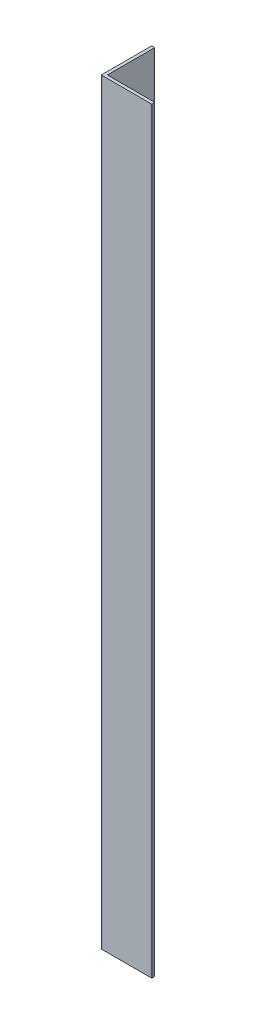
ISO-10303-21;
HEADER;
FILE_DESCRIPTION(('STEP AP214'),'2;1');
FILE_NAME('part.step','',(''),(''),'','','');
FILE_SCHEMA(('AUTOMOTIVE_DESIGN { 1 0 10303 214 1 1 1 1 }'));
ENDSEC;
DATA;
#1=APPLICATION_CONTEXT('core data for automotive mechanical design processes');
#2=APPLICATION_PROTOCOL_DEFINITION('international standard','automotive_design',2000,#1);
#3=PRODUCT_CONTEXT('',#1,'mechanical');
#4=PRODUCT('Part','Part','',(#3));
#5=PRODUCT_RELATED_PRODUCT_CATEGORY('part','',(#4));
#6=PRODUCT_DEFINITION_FORMATION('','',#4);
#7=PRODUCT_DEFINITION_CONTEXT('part definition',#1,'design');
#8=PRODUCT_DEFINITION('design','',#6,#7);
#9=PRODUCT_DEFINITION_SHAPE('','',#8);
#10=(LENGTH_UNIT() NAMED_UNIT(*) SI_UNIT(.MILLI.,.METRE.));
#11=(NAMED_UNIT(*) PLANE_ANGLE_UNIT() SI_UNIT($,.RADIAN.));
#12=(NAMED_UNIT(*) SI_UNIT($,.STERADIAN.) SOLID_ANGLE_UNIT());
#13=UNCERTAINTY_MEASURE_WITH_UNIT(LENGTH_MEASURE(1.E-05),#10,'distance_accuracy_value','');
#14=(GEOMETRIC_REPRESENTATION_CONTEXT(3) GLOBAL_UNCERTAINTY_ASSIGNED_CONTEXT((#13)) GLOBAL_UNIT_ASSIGNED_CONTEXT((#10,
#11,#12)) REPRESENTATION_CONTEXT('',''));
#15=CARTESIAN_POINT('',(0.,0.,0.));
#16=DIRECTION('',(0.,0.,1.));
#17=DIRECTION('',(1.,0.,0.));
#18=AXIS2_PLACEMENT_3D('',#15,#16,#17);
#19=CARTESIAN_POINT('',(8.88212560386474,300.,-0.200000000000002));
#20=DIRECTION('',(0.,-1.,0.));
#21=DIRECTION('',(0.,0.,-1.));
#22=AXIS2_PLACEMENT_3D('',#19,#20,#21);
#23=CYLINDRICAL_SURFACE('',#22,0.2);
#24=CARTESIAN_POINT('',(8.88212560386474,0.,-0.200000000000002));
#25=DIRECTION('',(0.,1.,0.));
#26=DIRECTION('',(0.,0.,-1.));
#27=AXIS2_PLACEMENT_3D('',#24,#25,#26);
#28=CIRCLE('',#27,0.2);
#29=CARTESIAN_POINT('',(8.88212560386474,0.,0.));
#30=VERTEX_POINT('',#29);
#31=CARTESIAN_POINT('',(9.08212560386474,0.,-0.200000000000004));
#32=VERTEX_POINT('',#31);
#33=EDGE_CURVE('E153',#30,#32,#28,.T.);
#34=ORIENTED_EDGE('',*,*,#33,.T.);
#35=DIRECTION('',(0.,-1.,0.));
#36=VECTOR('',#35,1.);
#37=CARTESIAN_POINT('',(9.08212560386474,300.,-0.200000000000004));
#38=LINE('',#37,#36);
#39=CARTESIAN_POINT('',(9.08212560386474,300.,-0.200000000000004));
#40=VERTEX_POINT('',#39);
#41=EDGE_CURVE('E11',#40,#32,#38,.T.);
#42=ORIENTED_EDGE('',*,*,#41,.F.);
#43=CARTESIAN_POINT('',(8.88212560386474,300.,-0.200000000000002));
#44=DIRECTION('',(0.,1.,0.));
#45=DIRECTION('',(0.,0.,-1.));
#46=AXIS2_PLACEMENT_3D('',#43,#44,#45);
#47=CIRCLE('',#46,0.2);
#48=CARTESIAN_POINT('',(8.88212560386474,300.,0.));
#49=VERTEX_POINT('',#48);
#50=EDGE_CURVE('E175',#49,#40,#47,.T.);
#51=ORIENTED_EDGE('',*,*,#50,.F.);
#52=DIRECTION('',(0.,-1.,0.));
#53=VECTOR('',#52,1.);
#54=CARTESIAN_POINT('',(8.88212560386474,300.,0.));
#55=LINE('',#54,#53);
#56=EDGE_CURVE('E149',#49,#30,#55,.T.);
#57=ORIENTED_EDGE('',*,*,#56,.T.);
#58=EDGE_LOOP('',(#34,#42,#51,#57));
#59=FACE_BOUND('',#58,.T.);
#60=ADVANCED_FACE('F33',(#59),#23,.T.);
#61=CARTESIAN_POINT('',(9.08212560386474,300.,-1.));
#62=DIRECTION('',(-1.,0.,0.));
#63=DIRECTION('',(0.,0.,1.));
#64=AXIS2_PLACEMENT_3D('',#61,#62,#63);
#65=PLANE('',#64);
#66=DIRECTION('',(0.,0.,-1.));
#67=VECTOR('',#66,1.);
#68=CARTESIAN_POINT('',(9.08212560386474,0.,-1.));
#69=LINE('',#68,#67);
#70=CARTESIAN_POINT('',(9.08212560386474,0.,-1.));
#71=VERTEX_POINT('',#70);
#72=EDGE_CURVE('E156',#32,#71,#69,.T.);
#73=ORIENTED_EDGE('',*,*,#72,.T.);
#74=DIRECTION('',(0.,-1.,0.));
#75=VECTOR('',#74,1.);
#76=CARTESIAN_POINT('',(9.08212560386474,300.,-1.));
#77=LINE('',#76,#75);
#78=CARTESIAN_POINT('',(9.08212560386474,300.,-1.));
#79=VERTEX_POINT('',#78);
#80=EDGE_CURVE('E41',#79,#71,#77,.T.);
#81=ORIENTED_EDGE('',*,*,#80,.F.);
#82=DIRECTION('',(0.,0.,-1.));
#83=VECTOR('',#82,1.);
#84=CARTESIAN_POINT('',(9.08212560386474,300.,-1.));
#85=LINE('',#84,#83);
#86=EDGE_CURVE('E104',#40,#79,#85,.T.);
#87=ORIENTED_EDGE('',*,*,#86,.F.);
#88=ORIENTED_EDGE('',*,*,#41,.T.);
#89=EDGE_LOOP('',(#73,#81,#87,#88));
#90=FACE_BOUND('',#89,.T.);
#91=ADVANCED_FACE('F253',(#90),#65,.F.);
#92=CARTESIAN_POINT('',(8.88212560386474,300.,-1.));
#93=DIRECTION('',(0.,-1.,0.));
#94=DIRECTION('',(0.,0.,-1.));
#95=AXIS2_PLACEMENT_3D('',#92,#93,#94);
#96=CYLINDRICAL_SURFACE('',#95,0.2);
#97=CARTESIAN_POINT('',(8.88212560386474,0.,-1.));
#98=DIRECTION('',(0.,1.,0.));
#99=DIRECTION('',(0.,0.,-1.));
#100=AXIS2_PLACEMENT_3D('',#97,#98,#99);
#101=CIRCLE('',#100,0.2);
#102=CARTESIAN_POINT('',(8.88212560386474,0.,-1.2));
#103=VERTEX_POINT('',#102);
#104=EDGE_CURVE('E158',#71,#103,#101,.T.);
#105=ORIENTED_EDGE('',*,*,#104,.T.);
#106=DIRECTION('',(0.,-1.,0.));
#107=VECTOR('',#106,1.);
#108=CARTESIAN_POINT('',(8.88212560386474,300.,-1.2));
#109=LINE('',#108,#107);
#110=CARTESIAN_POINT('',(8.88212560386474,300.,-1.2));
#111=VERTEX_POINT('',#110);
#112=EDGE_CURVE('E194',#111,#103,#109,.T.);
#113=ORIENTED_EDGE('',*,*,#112,.F.);
#114=CARTESIAN_POINT('',(8.88212560386474,300.,-1.));
#115=DIRECTION('',(0.,1.,0.));
#116=DIRECTION('',(0.,0.,-1.));
#117=AXIS2_PLACEMENT_3D('',#114,#115,#116);
#118=CIRCLE('',#117,0.2);
#119=EDGE_CURVE('E202',#79,#111,#118,.T.);
#120=ORIENTED_EDGE('',*,*,#119,.F.);
#121=ORIENTED_EDGE('',*,*,#80,.T.);
#122=EDGE_LOOP('',(#105,#113,#120,#121));
#123=FACE_BOUND('',#122,.T.);
#124=ADVANCED_FACE('F200',(#123),#96,.T.);
#125=CARTESIAN_POINT('',(-9.51787439613526,300.,-1.2));
#126=DIRECTION('',(0.,0.,1.));
#127=DIRECTION('',(1.,0.,0.));
#128=AXIS2_PLACEMENT_3D('',#125,#126,#127);
#129=PLANE('',#128);
#130=DIRECTION('',(-1.,0.,0.));
#131=VECTOR('',#130,1.);
#132=CARTESIAN_POINT('',(-9.51787439613526,0.,-1.2));
#133=LINE('',#132,#131);
#134=CARTESIAN_POINT('',(-9.51787439613526,0.,-1.2));
#135=VERTEX_POINT('',#134);
#136=EDGE_CURVE('E160',#103,#135,#133,.T.);
#137=ORIENTED_EDGE('',*,*,#136,.T.);
#138=DIRECTION('',(0.,-1.,0.));
#139=VECTOR('',#138,1.);
#140=CARTESIAN_POINT('',(-9.51787439613526,300.,-1.2));
#141=LINE('',#140,#139);
#142=CARTESIAN_POINT('',(-9.51787439613526,300.,-1.2));
#143=VERTEX_POINT('',#142);
#144=EDGE_CURVE('E191',#143,#135,#141,.T.);
#145=ORIENTED_EDGE('',*,*,#144,.F.);
#146=DIRECTION('',(-1.,0.,0.));
#147=VECTOR('',#146,1.);
#148=CARTESIAN_POINT('',(-9.51787439613526,300.,-1.2));
#149=LINE('',#148,#147);
#150=EDGE_CURVE('E220',#111,#143,#149,.T.);
#151=ORIENTED_EDGE('',*,*,#150,.F.);
#152=ORIENTED_EDGE('',*,*,#112,.T.);
#153=EDGE_LOOP('',(#137,#145,#151,#152));
#154=FACE_BOUND('',#153,.T.);
#155=ADVANCED_FACE('F211',(#154),#129,.F.);
#156=CARTESIAN_POINT('',(-9.51787439613526,300.,-1.4));
#157=DIRECTION('',(0.,-1.,0.));
#158=DIRECTION('',(0.,0.,-1.));
#159=AXIS2_PLACEMENT_3D('',#156,#157,#158);
#160=CYLINDRICAL_SURFACE('',#159,0.2);
#161=CARTESIAN_POINT('',(-9.51787439613526,0.,-1.4));
#162=DIRECTION('',(0.,-1.,0.));
#163=DIRECTION('',(0.,0.,1.));
#164=AXIS2_PLACEMENT_3D('',#161,#162,#163);
#165=CIRCLE('',#164,0.2);
#166=CARTESIAN_POINT('',(-9.71787439613526,0.,-1.4));
#167=VERTEX_POINT('',#166);
#168=EDGE_CURVE('E162',#135,#167,#165,.T.);
#169=ORIENTED_EDGE('',*,*,#168,.T.);
#170=DIRECTION('',(0.,-1.,0.));
#171=VECTOR('',#170,1.);
#172=CARTESIAN_POINT('',(-9.71787439613526,300.,-1.4));
#173=LINE('',#172,#171);
#174=CARTESIAN_POINT('',(-9.71787439613526,300.,-1.4));
#175=VERTEX_POINT('',#174);
#176=EDGE_CURVE('E188',#175,#167,#173,.T.);
#177=ORIENTED_EDGE('',*,*,#176,.F.);
#178=CARTESIAN_POINT('',(-9.51787439613526,300.,-1.4));
#179=DIRECTION('',(0.,-1.,0.));
#180=DIRECTION('',(0.,0.,1.));
#181=AXIS2_PLACEMENT_3D('',#178,#179,#180);
#182=CIRCLE('',#181,0.2);
#183=EDGE_CURVE('E217',#143,#175,#182,.T.);
#184=ORIENTED_EDGE('',*,*,#183,.F.);
#185=ORIENTED_EDGE('',*,*,#144,.T.);
#186=EDGE_LOOP('',(#169,#177,#184,#185));
#187=FACE_BOUND('',#186,.T.);
#188=ADVANCED_FACE('F215',(#187),#160,.F.);
#189=CARTESIAN_POINT('',(-9.71787439613526,300.,-19.8));
#190=DIRECTION('',(-1.,0.,0.));
#191=DIRECTION('',(0.,0.,1.));
#192=AXIS2_PLACEMENT_3D('',#189,#190,#191);
#193=PLANE('',#192);
#194=DIRECTION('',(0.,0.,-1.));
#195=VECTOR('',#194,1.);
#196=CARTESIAN_POINT('',(-9.71787439613526,0.,-19.8));
#197=LINE('',#196,#195);
#198=CARTESIAN_POINT('',(-9.71787439613526,0.,-19.8));
#199=VERTEX_POINT('',#198);
#200=EDGE_CURVE('E164',#167,#199,#197,.T.);
#201=ORIENTED_EDGE('',*,*,#200,.T.);
#202=DIRECTION('',(0.,-1.,0.));
#203=VECTOR('',#202,1.);
#204=CARTESIAN_POINT('',(-9.71787439613526,300.,-19.8));
#205=LINE('',#204,#203);
#206=CARTESIAN_POINT('',(-9.71787439613526,300.,-19.8));
#207=VERTEX_POINT('',#206);
#208=EDGE_CURVE('E185',#207,#199,#205,.T.);
#209=ORIENTED_EDGE('',*,*,#208,.F.);
#210=DIRECTION('',(0.,0.,-1.));
#211=VECTOR('',#210,1.);
#212=CARTESIAN_POINT('',(-9.71787439613526,300.,-19.8));
#213=LINE('',#212,#211);
#214=EDGE_CURVE('E219',#175,#207,#213,.T.);
#215=ORIENTED_EDGE('',*,*,#214,.F.);
#216=ORIENTED_EDGE('',*,*,#176,.T.);
#217=EDGE_LOOP('',(#201,#209,#215,#216));
#218=FACE_BOUND('',#217,.T.);
#219=ADVANCED_FACE('F266',(#218),#193,.F.);
#220=CARTESIAN_POINT('',(-9.91787439613526,300.,-19.8));
#221=DIRECTION('',(0.,-1.,0.));
#222=DIRECTION('',(0.,0.,-1.));
#223=AXIS2_PLACEMENT_3D('',#220,#221,#222);
#224=CYLINDRICAL_SURFACE('',#223,0.2);
#225=CARTESIAN_POINT('',(-9.91787439613526,0.,-19.8));
#226=DIRECTION('',(0.,1.,0.));
#227=DIRECTION('',(0.,0.,-1.));
#228=AXIS2_PLACEMENT_3D('',#225,#226,#227);
#229=CIRCLE('',#228,0.2);
#230=CARTESIAN_POINT('',(-9.91787439613526,0.,-20.));
#231=VERTEX_POINT('',#230);
#232=EDGE_CURVE('E166',#199,#231,#229,.T.);
#233=ORIENTED_EDGE('',*,*,#232,.T.);
#234=DIRECTION('',(0.,-1.,0.));
#235=VECTOR('',#234,1.);
#236=CARTESIAN_POINT('',(-9.91787439613526,300.,-20.));
#237=LINE('',#236,#235);
#238=CARTESIAN_POINT('',(-9.91787439613526,300.,-20.));
#239=VERTEX_POINT('',#238);
#240=EDGE_CURVE('E182',#239,#231,#237,.T.);
#241=ORIENTED_EDGE('',*,*,#240,.F.);
#242=CARTESIAN_POINT('',(-9.91787439613526,300.,-19.8));
#243=DIRECTION('',(0.,1.,0.));
#244=DIRECTION('',(0.,0.,-1.));
#245=AXIS2_PLACEMENT_3D('',#242,#243,#244);
#246=CIRCLE('',#245,0.2);
#247=EDGE_CURVE('E222',#207,#239,#246,.T.);
#248=ORIENTED_EDGE('',*,*,#247,.F.);
#249=ORIENTED_EDGE('',*,*,#208,.T.);
#250=EDGE_LOOP('',(#233,#241,#248,#249));
#251=FACE_BOUND('',#250,.T.);
#252=ADVANCED_FACE('F269',(#251),#224,.T.);
#253=CARTESIAN_POINT('',(-10.7178743961353,300.,-20.));
#254=DIRECTION('',(0.,0.,1.));
#255=DIRECTION('',(1.,0.,0.));
#256=AXIS2_PLACEMENT_3D('',#253,#254,#255);
#257=PLANE('',#256);
#258=DIRECTION('',(-1.,0.,0.));
#259=VECTOR('',#258,1.);
#260=CARTESIAN_POINT('',(-10.7178743961353,0.,-20.));
#261=LINE('',#260,#259);
#262=CARTESIAN_POINT('',(-10.7178743961353,0.,-20.));
#263=VERTEX_POINT('',#262);
#264=EDGE_CURVE('E168',#231,#263,#261,.T.);
#265=ORIENTED_EDGE('',*,*,#264,.T.);
#266=DIRECTION('',(0.,-1.,0.));
#267=VECTOR('',#266,1.);
#268=CARTESIAN_POINT('',(-10.7178743961353,300.,-20.));
#269=LINE('',#268,#267);
#270=CARTESIAN_POINT('',(-10.7178743961353,300.,-20.));
#271=VERTEX_POINT('',#270);
#272=EDGE_CURVE('E179',#271,#263,#269,.T.);
#273=ORIENTED_EDGE('',*,*,#272,.F.);
#274=DIRECTION('',(-1.,0.,0.));
#275=VECTOR('',#274,1.);
#276=CARTESIAN_POINT('',(-10.7178743961353,300.,-20.));
#277=LINE('',#276,#275);
#278=EDGE_CURVE('E228',#239,#271,#277,.T.);
#279=ORIENTED_EDGE('',*,*,#278,.F.);
#280=ORIENTED_EDGE('',*,*,#240,.T.);
#281=EDGE_LOOP('',(#265,#273,#279,#280));
#282=FACE_BOUND('',#281,.T.);
#283=ADVANCED_FACE('F234',(#282),#257,.F.);
#284=CARTESIAN_POINT('',(-10.7178743961353,300.,-19.8));
#285=DIRECTION('',(0.,-1.,0.));
#286=DIRECTION('',(0.,0.,-1.));
#287=AXIS2_PLACEMENT_3D('',#284,#285,#286);
#288=CYLINDRICAL_SURFACE('',#287,0.2);
#289=CARTESIAN_POINT('',(-10.7178743961353,0.,-19.8));
#290=DIRECTION('',(0.,1.,0.));
#291=DIRECTION('',(0.,0.,-1.));
#292=AXIS2_PLACEMENT_3D('',#289,#290,#291);
#293=CIRCLE('',#292,0.2);
#294=CARTESIAN_POINT('',(-10.9178743961353,0.,-19.8));
#295=VERTEX_POINT('',#294);
#296=EDGE_CURVE('E170',#263,#295,#293,.T.);
#297=ORIENTED_EDGE('',*,*,#296,.T.);
#298=DIRECTION('',(0.,-1.,0.));
#299=VECTOR('',#298,1.);
#300=CARTESIAN_POINT('',(-10.9178743961353,300.,-19.8));
#301=LINE('',#300,#299);
#302=CARTESIAN_POINT('',(-10.9178743961353,300.,-19.8));
#303=VERTEX_POINT('',#302);
#304=EDGE_CURVE('E144',#303,#295,#301,.T.);
#305=ORIENTED_EDGE('',*,*,#304,.F.);
#306=CARTESIAN_POINT('',(-10.7178743961353,300.,-19.8));
#307=DIRECTION('',(0.,1.,0.));
#308=DIRECTION('',(0.,0.,-1.));
#309=AXIS2_PLACEMENT_3D('',#306,#307,#308);
#310=CIRCLE('',#309,0.2);
#311=EDGE_CURVE('E135',#271,#303,#310,.T.);
#312=ORIENTED_EDGE('',*,*,#311,.F.);
#313=ORIENTED_EDGE('',*,*,#272,.T.);
#314=EDGE_LOOP('',(#297,#305,#312,#313));
#315=FACE_BOUND('',#314,.T.);
#316=ADVANCED_FACE('F238',(#315),#288,.T.);
#317=CARTESIAN_POINT('',(-10.9178743961353,300.,-0.200000000000001));
#318=DIRECTION('',(1.,0.,0.));
#319=DIRECTION('',(0.,0.,-1.));
#320=AXIS2_PLACEMENT_3D('',#317,#318,#319);
#321=PLANE('',#320);
#322=DIRECTION('',(0.,0.,1.));
#323=VECTOR('',#322,1.);
#324=CARTESIAN_POINT('',(-10.9178743961353,0.,-0.200000000000001));
#325=LINE('',#324,#323);
#326=CARTESIAN_POINT('',(-10.9178743961353,0.,-0.200000000000001));
#327=VERTEX_POINT('',#326);
#328=EDGE_CURVE('E143',#295,#327,#325,.T.);
#329=ORIENTED_EDGE('',*,*,#328,.T.);
#330=DIRECTION('',(0.,-1.,0.));
#331=VECTOR('',#330,1.);
#332=CARTESIAN_POINT('',(-10.9178743961353,300.,-0.200000000000001));
#333=LINE('',#332,#331);
#334=CARTESIAN_POINT('',(-10.9178743961353,300.,-0.200000000000001));
#335=VERTEX_POINT('',#334);
#336=EDGE_CURVE('E140',#335,#327,#333,.T.);
#337=ORIENTED_EDGE('',*,*,#336,.F.);
#338=DIRECTION('',(0.,0.,1.));
#339=VECTOR('',#338,1.);
#340=CARTESIAN_POINT('',(-10.9178743961353,300.,-0.200000000000001));
#341=LINE('',#340,#339);
#342=EDGE_CURVE('E129',#303,#335,#341,.T.);
#343=ORIENTED_EDGE('',*,*,#342,.F.);
#344=ORIENTED_EDGE('',*,*,#304,.T.);
#345=EDGE_LOOP('',(#329,#337,#343,#344));
#346=FACE_BOUND('',#345,.T.);
#347=ADVANCED_FACE('F141',(#346),#321,.F.);
#348=CARTESIAN_POINT('',(-10.7178743961353,300.,-0.2));
#349=DIRECTION('',(0.,-1.,0.));
#350=DIRECTION('',(0.,0.,-1.));
#351=AXIS2_PLACEMENT_3D('',#348,#349,#350);
#352=CYLINDRICAL_SURFACE('',#351,0.2);
#353=CARTESIAN_POINT('',(-10.7178743961353,0.,-0.2));
#354=DIRECTION('',(0.,1.,0.));
#355=DIRECTION('',(0.,0.,1.));
#356=AXIS2_PLACEMENT_3D('',#353,#354,#355);
#357=CIRCLE('',#356,0.2);
#358=CARTESIAN_POINT('',(-10.7178743961353,0.,0.));
#359=VERTEX_POINT('',#358);
#360=EDGE_CURVE('E90',#327,#359,#357,.T.);
#361=ORIENTED_EDGE('',*,*,#360,.T.);
#362=DIRECTION('',(0.,-1.,0.));
#363=VECTOR('',#362,1.);
#364=CARTESIAN_POINT('',(-10.7178743961353,300.,0.));
#365=LINE('',#364,#363);
#366=CARTESIAN_POINT('',(-10.7178743961353,300.,0.));
#367=VERTEX_POINT('',#366);
#368=EDGE_CURVE('E145',#367,#359,#365,.T.);
#369=ORIENTED_EDGE('',*,*,#368,.F.);
#370=CARTESIAN_POINT('',(-10.7178743961353,300.,-0.2));
#371=DIRECTION('',(0.,1.,0.));
#372=DIRECTION('',(0.,0.,1.));
#373=AXIS2_PLACEMENT_3D('',#370,#371,#372);
#374=CIRCLE('',#373,0.2);
#375=EDGE_CURVE('E133',#335,#367,#374,.T.);
#376=ORIENTED_EDGE('',*,*,#375,.F.);
#377=ORIENTED_EDGE('',*,*,#336,.T.);
#378=EDGE_LOOP('',(#361,#369,#376,#377));
#379=FACE_BOUND('',#378,.T.);
#380=ADVANCED_FACE('F147',(#379),#352,.T.);
#381=CARTESIAN_POINT('',(8.88212560386474,300.,0.));
#382=DIRECTION('',(0.,0.,-1.));
#383=DIRECTION('',(-1.,0.,0.));
#384=AXIS2_PLACEMENT_3D('',#381,#382,#383);
#385=PLANE('',#384);
#386=DIRECTION('',(1.,0.,0.));
#387=VECTOR('',#386,1.);
#388=CARTESIAN_POINT('',(8.88212560386474,0.,0.));
#389=LINE('',#388,#387);
#390=EDGE_CURVE('E96',#359,#30,#389,.T.);
#391=ORIENTED_EDGE('',*,*,#390,.T.);
#392=ORIENTED_EDGE('',*,*,#56,.F.);
#393=DIRECTION('',(1.,0.,0.));
#394=VECTOR('',#393,1.);
#395=CARTESIAN_POINT('',(8.88212560386474,300.,0.));
#396=LINE('',#395,#394);
#397=EDGE_CURVE('E49',#367,#49,#396,.T.);
#398=ORIENTED_EDGE('',*,*,#397,.F.);
#399=ORIENTED_EDGE('',*,*,#368,.T.);
#400=EDGE_LOOP('',(#391,#392,#398,#399));
#401=FACE_BOUND('',#400,.T.);
#402=ADVANCED_FACE('F242',(#401),#385,.F.);
#403=CARTESIAN_POINT('',(8.88212560386474,300.,-0.200000000000002));
#404=DIRECTION('',(0.,-1.,0.));
#405=DIRECTION('',(0.,0.,-1.));
#406=AXIS2_PLACEMENT_3D('',#403,#404,#405);
#407=PLANE('',#406);
#408=ORIENTED_EDGE('',*,*,#50,.T.);
#409=ORIENTED_EDGE('',*,*,#86,.T.);
#410=ORIENTED_EDGE('',*,*,#119,.T.);
#411=ORIENTED_EDGE('',*,*,#150,.T.);
#412=ORIENTED_EDGE('',*,*,#183,.T.);
#413=ORIENTED_EDGE('',*,*,#214,.T.);
#414=ORIENTED_EDGE('',*,*,#247,.T.);
#415=ORIENTED_EDGE('',*,*,#278,.T.);
#416=ORIENTED_EDGE('',*,*,#311,.T.);
#417=ORIENTED_EDGE('',*,*,#342,.T.);
#418=ORIENTED_EDGE('',*,*,#375,.T.);
#419=ORIENTED_EDGE('',*,*,#397,.T.);
#420=EDGE_LOOP('',(#408,#409,#410,#411,#412,#413,#414,#415,#416,#417,#418,#419));
#421=FACE_BOUND('',#420,.T.);
#422=ADVANCED_FACE('F131',(#421),#407,.F.);
#423=CARTESIAN_POINT('',(8.88212560386474,0.,-0.200000000000002));
#424=DIRECTION('',(0.,-1.,0.));
#425=DIRECTION('',(0.,0.,-1.));
#426=AXIS2_PLACEMENT_3D('',#423,#424,#425);
#427=PLANE('',#426);
#428=ORIENTED_EDGE('',*,*,#33,.F.);
#429=ORIENTED_EDGE('',*,*,#390,.F.);
#430=ORIENTED_EDGE('',*,*,#360,.F.);
#431=ORIENTED_EDGE('',*,*,#328,.F.);
#432=ORIENTED_EDGE('',*,*,#296,.F.);
#433=ORIENTED_EDGE('',*,*,#264,.F.);
#434=ORIENTED_EDGE('',*,*,#232,.F.);
#435=ORIENTED_EDGE('',*,*,#200,.F.);
#436=ORIENTED_EDGE('',*,*,#168,.F.);
#437=ORIENTED_EDGE('',*,*,#136,.F.);
#438=ORIENTED_EDGE('',*,*,#104,.F.);
#439=ORIENTED_EDGE('',*,*,#72,.F.);
#440=EDGE_LOOP('',(#428,#429,#430,#431,#432,#433,#434,#435,#436,#437,#438,#439));
#441=FACE_BOUND('',#440,.T.);
#442=ADVANCED_FACE('F206',(#441),#427,.T.);
#443=CLOSED_SHELL('',(#60,#91,#124,#155,#188,#219,#252,#283,#316,#347,#380,#402,#422,#442));
#444=MANIFOLD_SOLID_BREP('B2',#443);
#445=ADVANCED_BREP_SHAPE_REPRESENTATION('',(#18,#444),#14);
#446=SHAPE_DEFINITION_REPRESENTATION(#9,#445);
ENDSEC;
END-ISO-10303-21;
